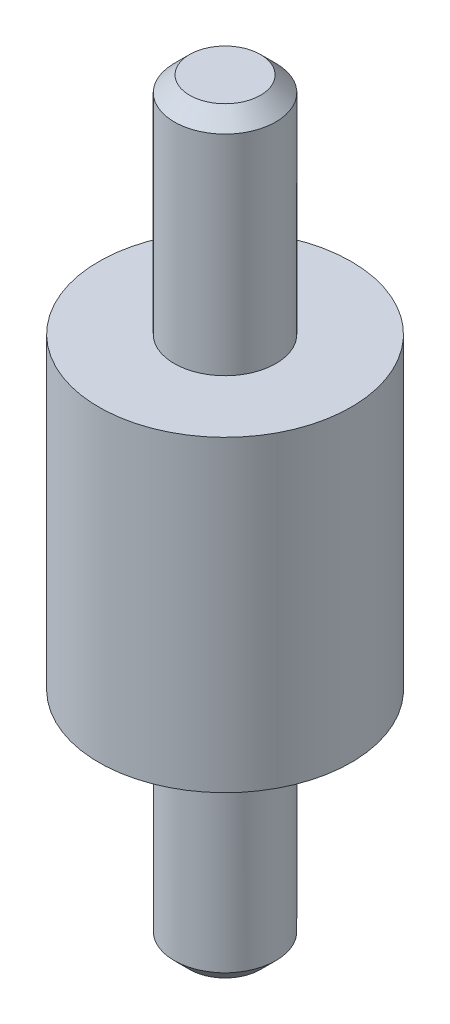
ISO-10303-21;
HEADER;
FILE_DESCRIPTION(('STEP AP214'),'2;1');
FILE_NAME('part.step','',(''),(''),'','','');
FILE_SCHEMA(('AUTOMOTIVE_DESIGN { 1 0 10303 214 1 1 1 1 }'));
ENDSEC;
DATA;
#1=APPLICATION_CONTEXT('core data for automotive mechanical design processes');
#2=APPLICATION_PROTOCOL_DEFINITION('international standard','automotive_design',2000,#1);
#3=PRODUCT_CONTEXT('',#1,'mechanical');
#4=PRODUCT('Part','Part','',(#3));
#5=PRODUCT_RELATED_PRODUCT_CATEGORY('part','',(#4));
#6=PRODUCT_DEFINITION_FORMATION('','',#4);
#7=PRODUCT_DEFINITION_CONTEXT('part definition',#1,'design');
#8=PRODUCT_DEFINITION('design','',#6,#7);
#9=PRODUCT_DEFINITION_SHAPE('','',#8);
#10=(LENGTH_UNIT() NAMED_UNIT(*) SI_UNIT(.MILLI.,.METRE.));
#11=(NAMED_UNIT(*) PLANE_ANGLE_UNIT() SI_UNIT($,.RADIAN.));
#12=(NAMED_UNIT(*) SI_UNIT($,.STERADIAN.) SOLID_ANGLE_UNIT());
#13=UNCERTAINTY_MEASURE_WITH_UNIT(LENGTH_MEASURE(1.E-05),#10,'distance_accuracy_value','');
#14=(GEOMETRIC_REPRESENTATION_CONTEXT(3) GLOBAL_UNCERTAINTY_ASSIGNED_CONTEXT((#13)) GLOBAL_UNIT_ASSIGNED_CONTEXT((#10,
#11,#12)) REPRESENTATION_CONTEXT('',''));
#15=CARTESIAN_POINT('',(0.,0.,0.));
#16=DIRECTION('',(0.,0.,1.));
#17=DIRECTION('',(1.,0.,0.));
#18=AXIS2_PLACEMENT_3D('',#15,#16,#17);
#19=CARTESIAN_POINT('',(0.,15.621,0.));
#20=DIRECTION('',(0.,1.,0.));
#21=DIRECTION('',(0.,0.,1.));
#22=AXIS2_PLACEMENT_3D('',#19,#20,#21);
#23=PLANE('',#22);
#24=CARTESIAN_POINT('',(0.,15.6210000000669,0.));
#25=DIRECTION('',(0.,-1.,0.));
#26=DIRECTION('',(0.,0.,-1.));
#27=AXIS2_PLACEMENT_3D('',#24,#25,#26);
#28=CIRCLE('',#27,1.46050000000741);
#29=CARTESIAN_POINT('',(0.,15.6210000000669,-1.46050000000741));
#30=VERTEX_POINT('',#29);
#31=EDGE_CURVE('E18',#30,#30,#28,.T.);
#32=ORIENTED_EDGE('',*,*,#31,.F.);
#33=EDGE_LOOP('',(#32));
#34=FACE_BOUND('',#33,.T.);
#35=ADVANCED_FACE('F15',(#34),#23,.T.);
#36=CARTESIAN_POINT('',(0.,-15.621,0.));
#37=DIRECTION('',(0.,1.,0.));
#38=DIRECTION('',(0.,0.,1.));
#39=AXIS2_PLACEMENT_3D('',#36,#37,#38);
#40=PLANE('',#39);
#41=CARTESIAN_POINT('',(0.,-15.6210000000101,0.));
#42=DIRECTION('',(0.,1.,0.));
#43=DIRECTION('',(0.,0.,1.));
#44=AXIS2_PLACEMENT_3D('',#41,#42,#43);
#45=CIRCLE('',#44,1.46050000006426);
#46=CARTESIAN_POINT('',(0.,-15.6210000000101,1.46050000006426));
#47=VERTEX_POINT('',#46);
#48=EDGE_CURVE('E38',#47,#47,#45,.T.);
#49=ORIENTED_EDGE('',*,*,#48,.F.);
#50=EDGE_LOOP('',(#49));
#51=FACE_BOUND('',#50,.T.);
#52=ADVANCED_FACE('F50',(#51),#40,.F.);
#53=CARTESIAN_POINT('',(0.,14.9860000000217,0.));
#54=DIRECTION('',(0.,-1.,0.));
#55=DIRECTION('',(0.,0.,-1.));
#56=AXIS2_PLACEMENT_3D('',#53,#54,#55);
#57=CONICAL_SURFACE('',#56,2.09550000005265,0.785398163397448);
#58=ORIENTED_EDGE('',*,*,#31,.T.);
#59=EDGE_LOOP('',(#58));
#60=FACE_BOUND('',#59,.T.);
#61=CARTESIAN_POINT('',(0.,14.986,0.));
#62=DIRECTION('',(0.,-1.,0.));
#63=DIRECTION('',(0.,0.,-1.));
#64=AXIS2_PLACEMENT_3D('',#61,#62,#63);
#65=CIRCLE('',#64,2.0955);
#66=CARTESIAN_POINT('',(0.,14.986,-2.0955));
#67=VERTEX_POINT('',#66);
#68=EDGE_CURVE('E30',#67,#67,#65,.T.);
#69=ORIENTED_EDGE('',*,*,#68,.F.);
#70=EDGE_LOOP('',(#69));
#71=FACE_BOUND('',#70,.T.);
#72=ADVANCED_FACE('F46',(#60,#71),#57,.T.);
#73=CARTESIAN_POINT('',(0.,-14.9860000000217,0.));
#74=DIRECTION('',(0.,1.,0.));
#75=DIRECTION('',(0.,0.,1.));
#76=AXIS2_PLACEMENT_3D('',#73,#74,#75);
#77=CONICAL_SURFACE('',#76,2.09549999999581,0.78539816335269);
#78=CARTESIAN_POINT('',(0.,-14.986,0.));
#79=DIRECTION('',(0.,-1.,0.));
#80=DIRECTION('',(0.,0.,-1.));
#81=AXIS2_PLACEMENT_3D('',#78,#79,#80);
#82=CIRCLE('',#81,2.0955);
#83=CARTESIAN_POINT('',(0.,-14.986,-2.0955));
#84=VERTEX_POINT('',#83);
#85=EDGE_CURVE('E37',#84,#84,#82,.F.);
#86=ORIENTED_EDGE('',*,*,#85,.F.);
#87=EDGE_LOOP('',(#86));
#88=FACE_BOUND('',#87,.T.);
#89=ORIENTED_EDGE('',*,*,#48,.T.);
#90=EDGE_LOOP('',(#89));
#91=FACE_BOUND('',#90,.T.);
#92=ADVANCED_FACE('F77',(#88,#91),#77,.T.);
#93=CARTESIAN_POINT('',(0.,15.621,0.));
#94=DIRECTION('',(0.,-1.,0.));
#95=DIRECTION('',(0.,0.,-1.));
#96=AXIS2_PLACEMENT_3D('',#93,#94,#95);
#97=CYLINDRICAL_SURFACE('',#96,2.0955);
#98=ORIENTED_EDGE('',*,*,#68,.T.);
#99=EDGE_LOOP('',(#98));
#100=FACE_BOUND('',#99,.T.);
#101=CARTESIAN_POINT('',(0.,6.35,0.));
#102=DIRECTION('',(0.,-1.,0.));
#103=DIRECTION('',(0.,0.,-1.));
#104=AXIS2_PLACEMENT_3D('',#101,#102,#103);
#105=CIRCLE('',#104,2.0955);
#106=CARTESIAN_POINT('',(0.,6.35,-2.0955));
#107=VERTEX_POINT('',#106);
#108=EDGE_CURVE('E35',#107,#107,#105,.T.);
#109=ORIENTED_EDGE('',*,*,#108,.F.);
#110=EDGE_LOOP('',(#109));
#111=FACE_BOUND('',#110,.T.);
#112=ADVANCED_FACE('F73',(#100,#111),#97,.T.);
#113=CARTESIAN_POINT('',(0.,15.621,0.));
#114=DIRECTION('',(0.,-1.,0.));
#115=DIRECTION('',(0.,0.,-1.));
#116=AXIS2_PLACEMENT_3D('',#113,#114,#115);
#117=CYLINDRICAL_SURFACE('',#116,2.0955);
#118=ORIENTED_EDGE('',*,*,#85,.T.);
#119=EDGE_LOOP('',(#118));
#120=FACE_BOUND('',#119,.T.);
#121=CARTESIAN_POINT('',(0.,-6.35,0.));
#122=DIRECTION('',(0.,-1.,0.));
#123=DIRECTION('',(0.,0.,-1.));
#124=AXIS2_PLACEMENT_3D('',#121,#122,#123);
#125=CIRCLE('',#124,2.0955);
#126=CARTESIAN_POINT('',(0.,-6.35,-2.0955));
#127=VERTEX_POINT('',#126);
#128=EDGE_CURVE('E27',#127,#127,#125,.T.);
#129=ORIENTED_EDGE('',*,*,#128,.T.);
#130=EDGE_LOOP('',(#129));
#131=FACE_BOUND('',#130,.T.);
#132=ADVANCED_FACE('F69',(#120,#131),#117,.T.);
#133=CARTESIAN_POINT('',(0.,6.35,0.));
#134=DIRECTION('',(0.,1.,0.));
#135=DIRECTION('',(0.,0.,1.));
#136=AXIS2_PLACEMENT_3D('',#133,#134,#135);
#137=PLANE('',#136);
#138=ORIENTED_EDGE('',*,*,#108,.T.);
#139=EDGE_LOOP('',(#138));
#140=FACE_BOUND('',#139,.T.);
#141=CARTESIAN_POINT('',(0.,6.35,0.));
#142=DIRECTION('',(0.,-1.,0.));
#143=DIRECTION('',(0.,0.,-1.));
#144=AXIS2_PLACEMENT_3D('',#141,#142,#143);
#145=CIRCLE('',#144,5.207);
#146=CARTESIAN_POINT('',(0.,6.35,-5.207));
#147=VERTEX_POINT('',#146);
#148=EDGE_CURVE('E22',#147,#147,#145,.T.);
#149=ORIENTED_EDGE('',*,*,#148,.F.);
#150=EDGE_LOOP('',(#149));
#151=FACE_BOUND('',#150,.T.);
#152=ADVANCED_FACE('F62',(#140,#151),#137,.T.);
#153=CARTESIAN_POINT('',(0.,-6.35,0.));
#154=DIRECTION('',(0.,1.,0.));
#155=DIRECTION('',(0.,0.,1.));
#156=AXIS2_PLACEMENT_3D('',#153,#154,#155);
#157=PLANE('',#156);
#158=ORIENTED_EDGE('',*,*,#128,.F.);
#159=EDGE_LOOP('',(#158));
#160=FACE_BOUND('',#159,.T.);
#161=CARTESIAN_POINT('',(0.,-6.35,0.));
#162=DIRECTION('',(0.,-1.,0.));
#163=DIRECTION('',(0.,0.,-1.));
#164=AXIS2_PLACEMENT_3D('',#161,#162,#163);
#165=CIRCLE('',#164,5.207);
#166=CARTESIAN_POINT('',(0.,-6.35,-5.207));
#167=VERTEX_POINT('',#166);
#168=EDGE_CURVE('E9',#167,#167,#165,.F.);
#169=ORIENTED_EDGE('',*,*,#168,.F.);
#170=EDGE_LOOP('',(#169));
#171=FACE_BOUND('',#170,.T.);
#172=ADVANCED_FACE('F57',(#160,#171),#157,.F.);
#173=CARTESIAN_POINT('',(0.,6.35,0.));
#174=DIRECTION('',(0.,-1.,0.));
#175=DIRECTION('',(0.,0.,-1.));
#176=AXIS2_PLACEMENT_3D('',#173,#174,#175);
#177=CYLINDRICAL_SURFACE('',#176,5.207);
#178=ORIENTED_EDGE('',*,*,#168,.T.);
#179=EDGE_LOOP('',(#178));
#180=FACE_BOUND('',#179,.T.);
#181=ORIENTED_EDGE('',*,*,#148,.T.);
#182=EDGE_LOOP('',(#181));
#183=FACE_BOUND('',#182,.T.);
#184=ADVANCED_FACE('F55',(#180,#183),#177,.T.);
#185=CLOSED_SHELL('',(#35,#52,#72,#92,#112,#132,#152,#172,#184));
#186=MANIFOLD_SOLID_BREP('B1',#185);
#187=ADVANCED_BREP_SHAPE_REPRESENTATION('',(#18,#186),#14);
#188=SHAPE_DEFINITION_REPRESENTATION(#9,#187);
ENDSEC;
END-ISO-10303-21;
